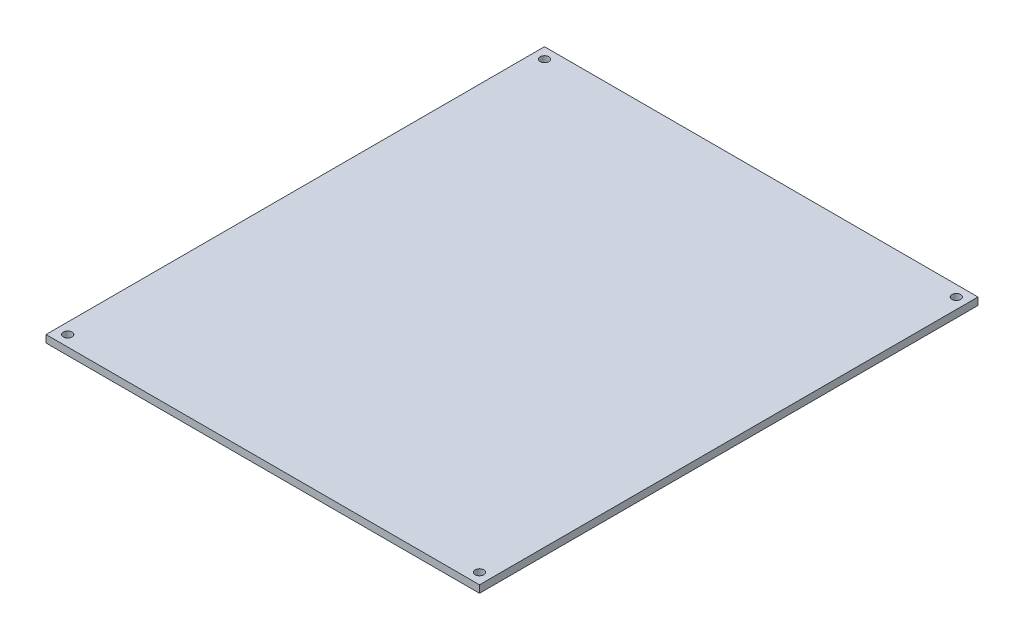
ISO-10303-21;
HEADER;
FILE_DESCRIPTION(('STEP AP214'),'2;1');
FILE_NAME('part.step','',(''),(''),'','','');
FILE_SCHEMA(('AUTOMOTIVE_DESIGN { 1 0 10303 214 1 1 1 1 }'));
ENDSEC;
DATA;
#1=APPLICATION_CONTEXT('core data for automotive mechanical design processes');
#2=APPLICATION_PROTOCOL_DEFINITION('international standard','automotive_design',2000,#1);
#3=PRODUCT_CONTEXT('',#1,'mechanical');
#4=PRODUCT('Part','Part','',(#3));
#5=PRODUCT_RELATED_PRODUCT_CATEGORY('part','',(#4));
#6=PRODUCT_DEFINITION_FORMATION('','',#4);
#7=PRODUCT_DEFINITION_CONTEXT('part definition',#1,'design');
#8=PRODUCT_DEFINITION('design','',#6,#7);
#9=PRODUCT_DEFINITION_SHAPE('','',#8);
#10=(LENGTH_UNIT() NAMED_UNIT(*) SI_UNIT(.MILLI.,.METRE.));
#11=(NAMED_UNIT(*) PLANE_ANGLE_UNIT() SI_UNIT($,.RADIAN.));
#12=(NAMED_UNIT(*) SI_UNIT($,.STERADIAN.) SOLID_ANGLE_UNIT());
#13=UNCERTAINTY_MEASURE_WITH_UNIT(LENGTH_MEASURE(1.E-05),#10,'distance_accuracy_value','');
#14=(GEOMETRIC_REPRESENTATION_CONTEXT(3) GLOBAL_UNCERTAINTY_ASSIGNED_CONTEXT((#13)) GLOBAL_UNIT_ASSIGNED_CONTEXT((#10,
#11,#12)) REPRESENTATION_CONTEXT('',''));
#15=CARTESIAN_POINT('',(0.,0.,0.));
#16=DIRECTION('',(0.,0.,1.));
#17=DIRECTION('',(1.,0.,0.));
#18=AXIS2_PLACEMENT_3D('',#15,#16,#17);
#19=CARTESIAN_POINT('',(50.,1.7,57.5));
#20=DIRECTION('',(-1.,0.,0.));
#21=DIRECTION('',(0.,0.,1.));
#22=AXIS2_PLACEMENT_3D('',#19,#20,#21);
#23=PLANE('',#22);
#24=DIRECTION('',(0.,0.,-1.));
#25=VECTOR('',#24,1.);
#26=CARTESIAN_POINT('',(50.,0.,57.5));
#27=LINE('',#26,#25);
#28=CARTESIAN_POINT('',(50.,0.,57.5));
#29=VERTEX_POINT('',#28);
#30=CARTESIAN_POINT('',(50.,0.,-57.5));
#31=VERTEX_POINT('',#30);
#32=EDGE_CURVE('E98',#29,#31,#27,.T.);
#33=ORIENTED_EDGE('',*,*,#32,.T.);
#34=DIRECTION('',(0.,-1.,0.));
#35=VECTOR('',#34,1.);
#36=CARTESIAN_POINT('',(50.,1.7,-57.5));
#37=LINE('',#36,#35);
#38=CARTESIAN_POINT('',(50.,1.7,-57.5));
#39=VERTEX_POINT('',#38);
#40=EDGE_CURVE('E11',#39,#31,#37,.T.);
#41=ORIENTED_EDGE('',*,*,#40,.F.);
#42=DIRECTION('',(0.,0.,-1.));
#43=VECTOR('',#42,1.);
#44=CARTESIAN_POINT('',(50.,1.7,57.5));
#45=LINE('',#44,#43);
#46=CARTESIAN_POINT('',(50.,1.7,57.5));
#47=VERTEX_POINT('',#46);
#48=EDGE_CURVE('E86',#47,#39,#45,.T.);
#49=ORIENTED_EDGE('',*,*,#48,.F.);
#50=DIRECTION('',(0.,-1.,0.));
#51=VECTOR('',#50,1.);
#52=CARTESIAN_POINT('',(50.,1.7,57.5));
#53=LINE('',#52,#51);
#54=EDGE_CURVE('E94',#47,#29,#53,.T.);
#55=ORIENTED_EDGE('',*,*,#54,.T.);
#56=EDGE_LOOP('',(#33,#41,#49,#55));
#57=FACE_BOUND('',#56,.T.);
#58=ADVANCED_FACE('F35',(#57),#23,.F.);
#59=CARTESIAN_POINT('',(-50.,1.7,-57.5));
#60=DIRECTION('',(0.,0.,1.));
#61=DIRECTION('',(1.,0.,0.));
#62=AXIS2_PLACEMENT_3D('',#59,#60,#61);
#63=PLANE('',#62);
#64=DIRECTION('',(-1.,0.,0.));
#65=VECTOR('',#64,1.);
#66=CARTESIAN_POINT('',(-50.,0.,-57.5));
#67=LINE('',#66,#65);
#68=CARTESIAN_POINT('',(-50.,0.,-57.5));
#69=VERTEX_POINT('',#68);
#70=EDGE_CURVE('E90',#31,#69,#67,.T.);
#71=ORIENTED_EDGE('',*,*,#70,.T.);
#72=DIRECTION('',(0.,-1.,0.));
#73=VECTOR('',#72,1.);
#74=CARTESIAN_POINT('',(-50.,1.7,-57.5));
#75=LINE('',#74,#73);
#76=CARTESIAN_POINT('',(-50.,1.7,-57.5));
#77=VERTEX_POINT('',#76);
#78=EDGE_CURVE('E43',#77,#69,#75,.T.);
#79=ORIENTED_EDGE('',*,*,#78,.F.);
#80=DIRECTION('',(-1.,0.,0.));
#81=VECTOR('',#80,1.);
#82=CARTESIAN_POINT('',(-50.,1.7,-57.5));
#83=LINE('',#82,#81);
#84=EDGE_CURVE('E81',#39,#77,#83,.T.);
#85=ORIENTED_EDGE('',*,*,#84,.F.);
#86=ORIENTED_EDGE('',*,*,#40,.T.);
#87=EDGE_LOOP('',(#71,#79,#85,#86));
#88=FACE_BOUND('',#87,.T.);
#89=ADVANCED_FACE('F89',(#88),#63,.F.);
#90=CARTESIAN_POINT('',(-50.,1.7,57.5));
#91=DIRECTION('',(1.,0.,0.));
#92=DIRECTION('',(0.,0.,-1.));
#93=AXIS2_PLACEMENT_3D('',#90,#91,#92);
#94=PLANE('',#93);
#95=DIRECTION('',(0.,0.,1.));
#96=VECTOR('',#95,1.);
#97=CARTESIAN_POINT('',(-50.,0.,57.5));
#98=LINE('',#97,#96);
#99=CARTESIAN_POINT('',(-50.,0.,57.5));
#100=VERTEX_POINT('',#99);
#101=EDGE_CURVE('E68',#69,#100,#98,.T.);
#102=ORIENTED_EDGE('',*,*,#101,.T.);
#103=DIRECTION('',(0.,-1.,0.));
#104=VECTOR('',#103,1.);
#105=CARTESIAN_POINT('',(-50.,1.7,57.5));
#106=LINE('',#105,#104);
#107=CARTESIAN_POINT('',(-50.,1.7,57.5));
#108=VERTEX_POINT('',#107);
#109=EDGE_CURVE('E91',#108,#100,#106,.T.);
#110=ORIENTED_EDGE('',*,*,#109,.F.);
#111=DIRECTION('',(0.,0.,1.));
#112=VECTOR('',#111,1.);
#113=CARTESIAN_POINT('',(-50.,1.7,57.5));
#114=LINE('',#113,#112);
#115=EDGE_CURVE('E84',#77,#108,#114,.T.);
#116=ORIENTED_EDGE('',*,*,#115,.F.);
#117=ORIENTED_EDGE('',*,*,#78,.T.);
#118=EDGE_LOOP('',(#102,#110,#116,#117));
#119=FACE_BOUND('',#118,.T.);
#120=ADVANCED_FACE('F92',(#119),#94,.F.);
#121=CARTESIAN_POINT('',(-50.,1.7,57.5));
#122=DIRECTION('',(0.,0.,-1.));
#123=DIRECTION('',(-1.,0.,0.));
#124=AXIS2_PLACEMENT_3D('',#121,#122,#123);
#125=PLANE('',#124);
#126=DIRECTION('',(1.,0.,0.));
#127=VECTOR('',#126,1.);
#128=CARTESIAN_POINT('',(-50.,0.,57.5));
#129=LINE('',#128,#127);
#130=EDGE_CURVE('E74',#100,#29,#129,.T.);
#131=ORIENTED_EDGE('',*,*,#130,.T.);
#132=ORIENTED_EDGE('',*,*,#54,.F.);
#133=DIRECTION('',(1.,0.,0.));
#134=VECTOR('',#133,1.);
#135=CARTESIAN_POINT('',(-50.,1.7,57.5));
#136=LINE('',#135,#134);
#137=EDGE_CURVE('E51',#108,#47,#136,.T.);
#138=ORIENTED_EDGE('',*,*,#137,.F.);
#139=ORIENTED_EDGE('',*,*,#109,.T.);
#140=EDGE_LOOP('',(#131,#132,#138,#139));
#141=FACE_BOUND('',#140,.T.);
#142=ADVANCED_FACE('F106',(#141),#125,.F.);
#143=CARTESIAN_POINT('',(0.,1.7,0.));
#144=DIRECTION('',(0.,-1.,0.));
#145=DIRECTION('',(0.,0.,-1.));
#146=AXIS2_PLACEMENT_3D('',#143,#144,#145);
#147=PLANE('',#146);
#148=CARTESIAN_POINT('',(47.5,1.7,-55.));
#149=DIRECTION('',(0.,-1.,0.));
#150=DIRECTION('',(0.,0.,-1.));
#151=AXIS2_PLACEMENT_3D('',#148,#149,#150);
#152=CIRCLE('',#151,0.999999999999998);
#153=CARTESIAN_POINT('',(47.5,1.7,-56.));
#154=VERTEX_POINT('',#153);
#155=EDGE_CURVE('E129',#154,#154,#152,.T.);
#156=ORIENTED_EDGE('',*,*,#155,.T.);
#157=EDGE_LOOP('',(#156));
#158=FACE_BOUND('',#157,.T.);
#159=CARTESIAN_POINT('',(-47.5,1.7,-55.));
#160=DIRECTION('',(0.,-1.,0.));
#161=DIRECTION('',(0.,0.,-1.));
#162=AXIS2_PLACEMENT_3D('',#159,#160,#161);
#163=CIRCLE('',#162,0.999999999999998);
#164=CARTESIAN_POINT('',(-47.5,1.7,-56.));
#165=VERTEX_POINT('',#164);
#166=EDGE_CURVE('E123',#165,#165,#163,.T.);
#167=ORIENTED_EDGE('',*,*,#166,.T.);
#168=EDGE_LOOP('',(#167));
#169=FACE_BOUND('',#168,.T.);
#170=CARTESIAN_POINT('',(-47.5,1.7,55.));
#171=DIRECTION('',(0.,-1.,0.));
#172=DIRECTION('',(0.,0.,-1.));
#173=AXIS2_PLACEMENT_3D('',#170,#171,#172);
#174=CIRCLE('',#173,0.999999999999998);
#175=CARTESIAN_POINT('',(-47.5,1.7,54.));
#176=VERTEX_POINT('',#175);
#177=EDGE_CURVE('E117',#176,#176,#174,.T.);
#178=ORIENTED_EDGE('',*,*,#177,.T.);
#179=EDGE_LOOP('',(#178));
#180=FACE_BOUND('',#179,.T.);
#181=CARTESIAN_POINT('',(47.5,1.7,55.));
#182=DIRECTION('',(0.,-1.,0.));
#183=DIRECTION('',(0.,0.,-1.));
#184=AXIS2_PLACEMENT_3D('',#181,#182,#183);
#185=CIRCLE('',#184,0.999999999999998);
#186=CARTESIAN_POINT('',(47.5,1.7,54.));
#187=VERTEX_POINT('',#186);
#188=EDGE_CURVE('E101',#187,#187,#185,.T.);
#189=ORIENTED_EDGE('',*,*,#188,.T.);
#190=EDGE_LOOP('',(#189));
#191=FACE_BOUND('',#190,.T.);
#192=ORIENTED_EDGE('',*,*,#48,.T.);
#193=ORIENTED_EDGE('',*,*,#84,.T.);
#194=ORIENTED_EDGE('',*,*,#115,.T.);
#195=ORIENTED_EDGE('',*,*,#137,.T.);
#196=EDGE_LOOP('',(#192,#193,#194,#195));
#197=FACE_BOUND('',#196,.T.);
#198=ADVANCED_FACE('F82',(#158,#169,#180,#191,#197),#147,.F.);
#199=CARTESIAN_POINT('',(0.,0.,0.));
#200=DIRECTION('',(0.,-1.,0.));
#201=DIRECTION('',(0.,0.,-1.));
#202=AXIS2_PLACEMENT_3D('',#199,#200,#201);
#203=PLANE('',#202);
#204=CARTESIAN_POINT('',(47.5,0.,-55.));
#205=DIRECTION('',(0.,-1.,0.));
#206=DIRECTION('',(0.,0.,-1.));
#207=AXIS2_PLACEMENT_3D('',#204,#205,#206);
#208=CIRCLE('',#207,0.999999999999998);
#209=CARTESIAN_POINT('',(47.5,0.,-56.));
#210=VERTEX_POINT('',#209);
#211=EDGE_CURVE('E132',#210,#210,#208,.T.);
#212=ORIENTED_EDGE('',*,*,#211,.F.);
#213=EDGE_LOOP('',(#212));
#214=FACE_BOUND('',#213,.T.);
#215=CARTESIAN_POINT('',(-47.5,0.,-55.));
#216=DIRECTION('',(0.,-1.,0.));
#217=DIRECTION('',(0.,0.,-1.));
#218=AXIS2_PLACEMENT_3D('',#215,#216,#217);
#219=CIRCLE('',#218,0.999999999999998);
#220=CARTESIAN_POINT('',(-47.5,0.,-56.));
#221=VERTEX_POINT('',#220);
#222=EDGE_CURVE('E126',#221,#221,#219,.T.);
#223=ORIENTED_EDGE('',*,*,#222,.F.);
#224=EDGE_LOOP('',(#223));
#225=FACE_BOUND('',#224,.T.);
#226=CARTESIAN_POINT('',(-47.5,0.,55.));
#227=DIRECTION('',(0.,-1.,0.));
#228=DIRECTION('',(0.,0.,-1.));
#229=AXIS2_PLACEMENT_3D('',#226,#227,#228);
#230=CIRCLE('',#229,0.999999999999998);
#231=CARTESIAN_POINT('',(-47.5,0.,54.));
#232=VERTEX_POINT('',#231);
#233=EDGE_CURVE('E120',#232,#232,#230,.T.);
#234=ORIENTED_EDGE('',*,*,#233,.F.);
#235=EDGE_LOOP('',(#234));
#236=FACE_BOUND('',#235,.T.);
#237=CARTESIAN_POINT('',(47.5,0.,55.));
#238=DIRECTION('',(0.,-1.,0.));
#239=DIRECTION('',(0.,0.,-1.));
#240=AXIS2_PLACEMENT_3D('',#237,#238,#239);
#241=CIRCLE('',#240,0.999999999999998);
#242=CARTESIAN_POINT('',(47.5,0.,54.));
#243=VERTEX_POINT('',#242);
#244=EDGE_CURVE('E114',#243,#243,#241,.T.);
#245=ORIENTED_EDGE('',*,*,#244,.F.);
#246=EDGE_LOOP('',(#245));
#247=FACE_BOUND('',#246,.T.);
#248=ORIENTED_EDGE('',*,*,#32,.F.);
#249=ORIENTED_EDGE('',*,*,#130,.F.);
#250=ORIENTED_EDGE('',*,*,#101,.F.);
#251=ORIENTED_EDGE('',*,*,#70,.F.);
#252=EDGE_LOOP('',(#248,#249,#250,#251));
#253=FACE_BOUND('',#252,.T.);
#254=ADVANCED_FACE('F109',(#214,#225,#236,#247,#253),#203,.T.);
#255=CARTESIAN_POINT('',(47.5,21.7,55.));
#256=DIRECTION('',(0.,-1.,0.));
#257=DIRECTION('',(0.,0.,-1.));
#258=AXIS2_PLACEMENT_3D('',#255,#256,#257);
#259=CYLINDRICAL_SURFACE('',#258,0.999999999999998);
#260=ORIENTED_EDGE('',*,*,#244,.T.);
#261=EDGE_LOOP('',(#260));
#262=FACE_BOUND('',#261,.T.);
#263=ORIENTED_EDGE('',*,*,#188,.F.);
#264=EDGE_LOOP('',(#263));
#265=FACE_BOUND('',#264,.T.);
#266=ADVANCED_FACE('F141',(#262,#265),#259,.F.);
#267=CARTESIAN_POINT('',(-47.5,21.7,55.));
#268=DIRECTION('',(0.,-1.,0.));
#269=DIRECTION('',(0.,0.,-1.));
#270=AXIS2_PLACEMENT_3D('',#267,#268,#269);
#271=CYLINDRICAL_SURFACE('',#270,0.999999999999998);
#272=ORIENTED_EDGE('',*,*,#233,.T.);
#273=EDGE_LOOP('',(#272));
#274=FACE_BOUND('',#273,.T.);
#275=ORIENTED_EDGE('',*,*,#177,.F.);
#276=EDGE_LOOP('',(#275));
#277=FACE_BOUND('',#276,.T.);
#278=ADVANCED_FACE('F151',(#274,#277),#271,.F.);
#279=CARTESIAN_POINT('',(-47.5,21.7,-55.));
#280=DIRECTION('',(0.,-1.,0.));
#281=DIRECTION('',(0.,0.,-1.));
#282=AXIS2_PLACEMENT_3D('',#279,#280,#281);
#283=CYLINDRICAL_SURFACE('',#282,0.999999999999998);
#284=ORIENTED_EDGE('',*,*,#222,.T.);
#285=EDGE_LOOP('',(#284));
#286=FACE_BOUND('',#285,.T.);
#287=ORIENTED_EDGE('',*,*,#166,.F.);
#288=EDGE_LOOP('',(#287));
#289=FACE_BOUND('',#288,.T.);
#290=ADVANCED_FACE('F202',(#286,#289),#283,.F.);
#291=CARTESIAN_POINT('',(47.5,21.7,-55.));
#292=DIRECTION('',(0.,-1.,0.));
#293=DIRECTION('',(0.,0.,-1.));
#294=AXIS2_PLACEMENT_3D('',#291,#292,#293);
#295=CYLINDRICAL_SURFACE('',#294,0.999999999999998);
#296=ORIENTED_EDGE('',*,*,#211,.T.);
#297=EDGE_LOOP('',(#296));
#298=FACE_BOUND('',#297,.T.);
#299=ORIENTED_EDGE('',*,*,#155,.F.);
#300=EDGE_LOOP('',(#299));
#301=FACE_BOUND('',#300,.T.);
#302=ADVANCED_FACE('F136',(#298,#301),#295,.F.);
#303=CLOSED_SHELL('',(#58,#89,#120,#142,#198,#254,#266,#278,#290,#302));
#304=MANIFOLD_SOLID_BREP('B2',#303);
#305=ADVANCED_BREP_SHAPE_REPRESENTATION('',(#18,#304),#14);
#306=SHAPE_DEFINITION_REPRESENTATION(#9,#305);
ENDSEC;
END-ISO-10303-21;
